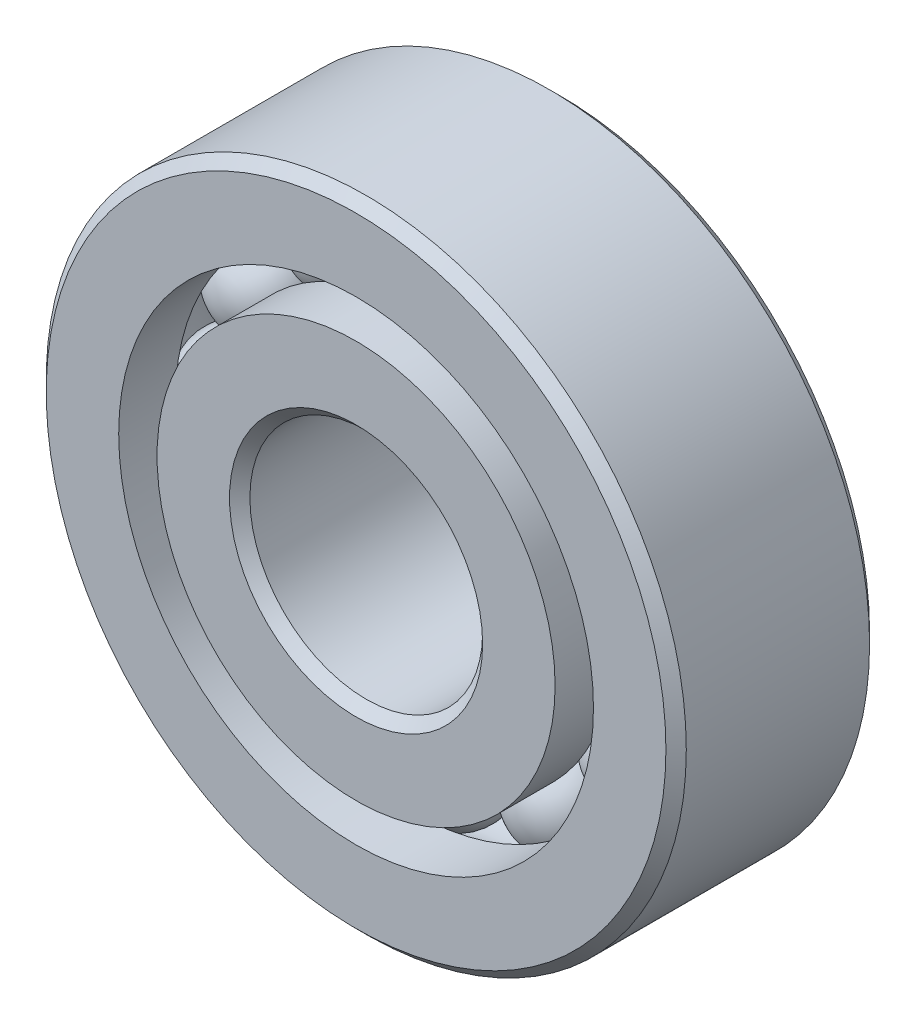
ISO-10303-21;
HEADER;
FILE_DESCRIPTION(('STEP AP214'),'2;1');
FILE_NAME('part.step','',(''),(''),'','','');
FILE_SCHEMA(('AUTOMOTIVE_DESIGN { 1 0 10303 214 1 1 1 1 }'));
ENDSEC;
DATA;
#1=APPLICATION_CONTEXT('core data for automotive mechanical design processes');
#2=APPLICATION_PROTOCOL_DEFINITION('international standard','automotive_design',2000,#1);
#3=PRODUCT_CONTEXT('',#1,'mechanical');
#4=PRODUCT('Part','Part','',(#3));
#5=PRODUCT_RELATED_PRODUCT_CATEGORY('part','',(#4));
#6=PRODUCT_DEFINITION_FORMATION('','',#4);
#7=PRODUCT_DEFINITION_CONTEXT('part definition',#1,'design');
#8=PRODUCT_DEFINITION('design','',#6,#7);
#9=PRODUCT_DEFINITION_SHAPE('','',#8);
#10=(LENGTH_UNIT() NAMED_UNIT(*) SI_UNIT(.MILLI.,.METRE.));
#11=(NAMED_UNIT(*) PLANE_ANGLE_UNIT() SI_UNIT($,.RADIAN.));
#12=(NAMED_UNIT(*) SI_UNIT($,.STERADIAN.) SOLID_ANGLE_UNIT());
#13=UNCERTAINTY_MEASURE_WITH_UNIT(LENGTH_MEASURE(1.E-05),#10,'distance_accuracy_value','');
#14=(GEOMETRIC_REPRESENTATION_CONTEXT(3) GLOBAL_UNCERTAINTY_ASSIGNED_CONTEXT((#13)) GLOBAL_UNIT_ASSIGNED_CONTEXT((#10,
#11,#12)) REPRESENTATION_CONTEXT('',''));
#15=CARTESIAN_POINT('',(0.,0.,0.));
#16=DIRECTION('',(0.,0.,1.));
#17=DIRECTION('',(1.,0.,0.));
#18=AXIS2_PLACEMENT_3D('',#15,#16,#17);
#19=CARTESIAN_POINT('',(-3.74999999999992,6.49519052838334,0.));
#20=DIRECTION('',(0.,0.,1.));
#21=DIRECTION('',(-0.499999999999989,0.866025403784445,0.));
#22=AXIS2_PLACEMENT_3D('',#19,#20,#21);
#23=SPHERICAL_SURFACE('',#22,1.68952158656808);
#24=CARTESIAN_POINT('',(-3.74999999999992,6.49519052838334,1.68952158656808));
#25=VERTEX_POINT('',#24);
#26=VERTEX_LOOP('',#25);
#27=FACE_BOUND('',#26,.T.);
#28=ADVANCED_FACE('F37',(#27),#23,.T.);
#29=CLOSED_SHELL('',(#28));
#30=MANIFOLD_SOLID_BREP('B2',#29);
#31=CARTESIAN_POINT('',(-6.49519052838325,3.75000000000008,0.));
#32=DIRECTION('',(0.,0.,1.));
#33=DIRECTION('',(-0.866025403784433,0.50000000000001,0.));
#34=AXIS2_PLACEMENT_3D('',#31,#32,#33);
#35=SPHERICAL_SURFACE('',#34,1.68952158656808);
#36=CARTESIAN_POINT('',(-6.49519052838325,3.75000000000008,1.68952158656808));
#37=VERTEX_POINT('',#36);
#38=VERTEX_LOOP('',#37);
#39=FACE_BOUND('',#38,.T.);
#40=ADVANCED_FACE('F57',(#39),#35,.T.);
#41=CLOSED_SHELL('',(#40));
#42=MANIFOLD_SOLID_BREP('B6',#41);
#43=CARTESIAN_POINT('',(-7.5,0.,0.));
#44=DIRECTION('',(0.,0.,1.));
#45=DIRECTION('',(-1.,0.,0.));
#46=AXIS2_PLACEMENT_3D('',#43,#44,#45);
#47=SPHERICAL_SURFACE('',#46,1.68952158656808);
#48=CARTESIAN_POINT('',(-7.5,0.,1.68952158656808));
#49=VERTEX_POINT('',#48);
#50=VERTEX_LOOP('',#49);
#51=FACE_BOUND('',#50,.T.);
#52=ADVANCED_FACE('F77',(#51),#47,.T.);
#53=CLOSED_SHELL('',(#52));
#54=MANIFOLD_SOLID_BREP('B33',#53);
#55=CARTESIAN_POINT('',(-6.49519052838332,-3.74999999999994,0.));
#56=DIRECTION('',(0.,0.,1.));
#57=DIRECTION('',(-0.866025403784443,-0.499999999999992,0.));
#58=AXIS2_PLACEMENT_3D('',#55,#56,#57);
#59=SPHERICAL_SURFACE('',#58,1.68952158656808);
#60=CARTESIAN_POINT('',(-6.49519052838332,-3.74999999999994,1.68952158656808));
#61=VERTEX_POINT('',#60);
#62=VERTEX_LOOP('',#61);
#63=FACE_BOUND('',#62,.T.);
#64=ADVANCED_FACE('F97',(#63),#59,.T.);
#65=CLOSED_SHELL('',(#64));
#66=MANIFOLD_SOLID_BREP('B53',#65);
#67=CARTESIAN_POINT('',(-3.75000000000005,-6.49519052838326,0.));
#68=DIRECTION('',(0.,0.,1.));
#69=DIRECTION('',(-0.500000000000007,-0.866025403784435,0.));
#70=AXIS2_PLACEMENT_3D('',#67,#68,#69);
#71=SPHERICAL_SURFACE('',#70,1.68952158656808);
#72=CARTESIAN_POINT('',(-3.75000000000005,-6.49519052838326,1.68952158656808));
#73=VERTEX_POINT('',#72);
#74=VERTEX_LOOP('',#73);
#75=FACE_BOUND('',#74,.T.);
#76=ADVANCED_FACE('F117',(#75),#71,.T.);
#77=CLOSED_SHELL('',(#76));
#78=MANIFOLD_SOLID_BREP('B73',#77);
#79=CARTESIAN_POINT('',(0.,-7.5,0.));
#80=DIRECTION('',(0.,0.,1.));
#81=DIRECTION('',(0.,-1.,0.));
#82=AXIS2_PLACEMENT_3D('',#79,#80,#81);
#83=SPHERICAL_SURFACE('',#82,1.68952158656808);
#84=CARTESIAN_POINT('',(0.,-7.5,1.68952158656808));
#85=VERTEX_POINT('',#84);
#86=VERTEX_LOOP('',#85);
#87=FACE_BOUND('',#86,.T.);
#88=ADVANCED_FACE('F137',(#87),#83,.T.);
#89=CLOSED_SHELL('',(#88));
#90=MANIFOLD_SOLID_BREP('B93',#89);
#91=CARTESIAN_POINT('',(3.74999999999996,-6.49519052838331,0.));
#92=DIRECTION('',(0.,0.,1.));
#93=DIRECTION('',(0.499999999999995,-0.866025403784442,0.));
#94=AXIS2_PLACEMENT_3D('',#91,#92,#93);
#95=SPHERICAL_SURFACE('',#94,1.68952158656808);
#96=CARTESIAN_POINT('',(3.74999999999996,-6.49519052838331,1.68952158656808));
#97=VERTEX_POINT('',#96);
#98=VERTEX_LOOP('',#97);
#99=FACE_BOUND('',#98,.T.);
#100=ADVANCED_FACE('F157',(#99),#95,.T.);
#101=CLOSED_SHELL('',(#100));
#102=MANIFOLD_SOLID_BREP('B113',#101);
#103=CARTESIAN_POINT('',(6.49519052838327,-3.75000000000003,0.));
#104=DIRECTION('',(0.,0.,1.));
#105=DIRECTION('',(0.866025403784436,-0.500000000000004,0.));
#106=AXIS2_PLACEMENT_3D('',#103,#104,#105);
#107=SPHERICAL_SURFACE('',#106,1.68952158656808);
#108=CARTESIAN_POINT('',(6.49519052838327,-3.75000000000003,1.68952158656808));
#109=VERTEX_POINT('',#108);
#110=VERTEX_LOOP('',#109);
#111=FACE_BOUND('',#110,.T.);
#112=ADVANCED_FACE('F177',(#111),#107,.T.);
#113=CLOSED_SHELL('',(#112));
#114=MANIFOLD_SOLID_BREP('B133',#113);
#115=CARTESIAN_POINT('',(7.5,0.,0.));
#116=DIRECTION('',(0.,0.,1.));
#117=DIRECTION('',(1.,0.,0.));
#118=AXIS2_PLACEMENT_3D('',#115,#116,#117);
#119=SPHERICAL_SURFACE('',#118,1.68952158656808);
#120=CARTESIAN_POINT('',(7.5,0.,1.68952158656808));
#121=VERTEX_POINT('',#120);
#122=VERTEX_LOOP('',#121);
#123=FACE_BOUND('',#122,.T.);
#124=ADVANCED_FACE('F197',(#123),#119,.T.);
#125=CLOSED_SHELL('',(#124));
#126=MANIFOLD_SOLID_BREP('B153',#125);
#127=CARTESIAN_POINT('',(6.4951905283833,3.74999999999998,0.));
#128=DIRECTION('',(0.,0.,1.));
#129=DIRECTION('',(0.86602540378444,0.499999999999998,0.));
#130=AXIS2_PLACEMENT_3D('',#127,#128,#129);
#131=SPHERICAL_SURFACE('',#130,1.68952158656808);
#132=CARTESIAN_POINT('',(6.4951905283833,3.74999999999998,1.68952158656808));
#133=VERTEX_POINT('',#132);
#134=VERTEX_LOOP('',#133);
#135=FACE_BOUND('',#134,.T.);
#136=ADVANCED_FACE('F217',(#135),#131,.T.);
#137=CLOSED_SHELL('',(#136));
#138=MANIFOLD_SOLID_BREP('B173',#137);
#139=CARTESIAN_POINT('',(3.75000000000001,6.49519052838328,0.));
#140=DIRECTION('',(0.,0.,1.));
#141=DIRECTION('',(0.500000000000001,0.866025403784438,0.));
#142=AXIS2_PLACEMENT_3D('',#139,#140,#141);
#143=SPHERICAL_SURFACE('',#142,1.68952158656808);
#144=CARTESIAN_POINT('',(3.75000000000001,6.49519052838328,1.68952158656808));
#145=VERTEX_POINT('',#144);
#146=VERTEX_LOOP('',#145);
#147=FACE_BOUND('',#146,.T.);
#148=ADVANCED_FACE('F237',(#147),#143,.T.);
#149=CLOSED_SHELL('',(#148));
#150=MANIFOLD_SOLID_BREP('B193',#149);
#151=CARTESIAN_POINT('',(0.,7.5,0.));
#152=DIRECTION('',(0.,0.,1.));
#153=DIRECTION('',(0.,1.,0.));
#154=AXIS2_PLACEMENT_3D('',#151,#152,#153);
#155=SPHERICAL_SURFACE('',#154,1.68952158656808);
#156=CARTESIAN_POINT('',(0.,7.5,1.68952158656808));
#157=VERTEX_POINT('',#156);
#158=VERTEX_LOOP('',#157);
#159=FACE_BOUND('',#158,.T.);
#160=ADVANCED_FACE('F259',(#159),#155,.T.);
#161=CLOSED_SHELL('',(#160));
#162=MANIFOLD_SOLID_BREP('B213',#161);
#163=CARTESIAN_POINT('',(0.,6.84065934065934,3.5));
#164=DIRECTION('',(0.,0.,-1.));
#165=DIRECTION('',(-1.,0.,0.));
#166=AXIS2_PLACEMENT_3D('',#163,#164,#165);
#167=PLANE('',#166);
#168=CARTESIAN_POINT('',(0.,0.,3.5));
#169=DIRECTION('',(0.,0.,1.));
#170=DIRECTION('',(1.,0.,0.));
#171=AXIS2_PLACEMENT_3D('',#168,#169,#170);
#172=CIRCLE('',#171,4.35);
#173=CARTESIAN_POINT('',(4.35,0.,3.5));
#174=VERTEX_POINT('',#173);
#175=EDGE_CURVE('E306',#174,#174,#172,.T.);
#176=ORIENTED_EDGE('',*,*,#175,.F.);
#177=EDGE_LOOP('',(#176));
#178=FACE_BOUND('',#177,.T.);
#179=CARTESIAN_POINT('',(0.,0.,3.5));
#180=DIRECTION('',(0.,0.,1.));
#181=DIRECTION('',(1.,0.,0.));
#182=AXIS2_PLACEMENT_3D('',#179,#180,#181);
#183=CIRCLE('',#182,6.84065934065934);
#184=CARTESIAN_POINT('',(6.84065934065934,0.,3.5));
#185=VERTEX_POINT('',#184);
#186=EDGE_CURVE('E258',#185,#185,#183,.T.);
#187=ORIENTED_EDGE('',*,*,#186,.T.);
#188=EDGE_LOOP('',(#187));
#189=FACE_BOUND('',#188,.T.);
#190=ADVANCED_FACE('F278',(#178,#189),#167,.F.);
#191=CARTESIAN_POINT('',(0.,0.,3.5));
#192=DIRECTION('',(0.,0.,1.));
#193=DIRECTION('',(1.,0.,0.));
#194=AXIS2_PLACEMENT_3D('',#191,#192,#193);
#195=CYLINDRICAL_SURFACE('',#194,6.84065934065934);
#196=ORIENTED_EDGE('',*,*,#186,.F.);
#197=EDGE_LOOP('',(#196));
#198=FACE_BOUND('',#197,.T.);
#199=CARTESIAN_POINT('',(0.,0.,1.55555555555556));
#200=DIRECTION('',(0.,0.,1.));
#201=DIRECTION('',(1.,0.,0.));
#202=AXIS2_PLACEMENT_3D('',#199,#200,#201);
#203=CIRCLE('',#202,6.84065934065934);
#204=CARTESIAN_POINT('',(6.84065934065934,0.,1.55555555555556));
#205=VERTEX_POINT('',#204);
#206=EDGE_CURVE('E284',#205,#205,#203,.T.);
#207=ORIENTED_EDGE('',*,*,#206,.T.);
#208=EDGE_LOOP('',(#207));
#209=FACE_BOUND('',#208,.T.);
#210=ADVANCED_FACE('F313',(#198,#209),#195,.T.);
#211=CARTESIAN_POINT('',(0.,0.,0.));
#212=DIRECTION('',(0.,0.,1.));
#213=DIRECTION('',(1.,0.,0.));
#214=AXIS2_PLACEMENT_3D('',#211,#212,#213);
#215=TOROIDAL_SURFACE('',#214,7.5,1.68952158656808);
#216=ORIENTED_EDGE('',*,*,#206,.F.);
#217=EDGE_LOOP('',(#216));
#218=FACE_BOUND('',#217,.T.);
#219=CARTESIAN_POINT('',(0.,0.,-1.55555555555556));
#220=DIRECTION('',(0.,0.,1.));
#221=DIRECTION('',(1.,0.,0.));
#222=AXIS2_PLACEMENT_3D('',#219,#220,#221);
#223=CIRCLE('',#222,6.84065934065934);
#224=CARTESIAN_POINT('',(6.84065934065934,0.,-1.55555555555556));
#225=VERTEX_POINT('',#224);
#226=EDGE_CURVE('E288',#225,#225,#223,.T.);
#227=ORIENTED_EDGE('',*,*,#226,.T.);
#228=EDGE_LOOP('',(#227));
#229=FACE_BOUND('',#228,.T.);
#230=ADVANCED_FACE('F317',(#218,#229),#215,.F.);
#231=CARTESIAN_POINT('',(0.,0.,3.5));
#232=DIRECTION('',(0.,0.,1.));
#233=DIRECTION('',(1.,0.,0.));
#234=AXIS2_PLACEMENT_3D('',#231,#232,#233);
#235=CYLINDRICAL_SURFACE('',#234,6.84065934065934);
#236=ORIENTED_EDGE('',*,*,#226,.F.);
#237=EDGE_LOOP('',(#236));
#238=FACE_BOUND('',#237,.T.);
#239=CARTESIAN_POINT('',(0.,0.,-3.5));
#240=DIRECTION('',(0.,0.,1.));
#241=DIRECTION('',(1.,0.,0.));
#242=AXIS2_PLACEMENT_3D('',#239,#240,#241);
#243=CIRCLE('',#242,6.84065934065934);
#244=CARTESIAN_POINT('',(6.84065934065934,0.,-3.5));
#245=VERTEX_POINT('',#244);
#246=EDGE_CURVE('E292',#245,#245,#243,.T.);
#247=ORIENTED_EDGE('',*,*,#246,.T.);
#248=EDGE_LOOP('',(#247));
#249=FACE_BOUND('',#248,.T.);
#250=ADVANCED_FACE('F322',(#238,#249),#235,.T.);
#251=CARTESIAN_POINT('',(0.,4.35,-3.5));
#252=DIRECTION('',(0.,0.,1.));
#253=DIRECTION('',(1.,0.,0.));
#254=AXIS2_PLACEMENT_3D('',#251,#252,#253);
#255=PLANE('',#254);
#256=ORIENTED_EDGE('',*,*,#246,.F.);
#257=EDGE_LOOP('',(#256));
#258=FACE_BOUND('',#257,.T.);
#259=CARTESIAN_POINT('',(0.,0.,-3.5));
#260=DIRECTION('',(0.,0.,1.));
#261=DIRECTION('',(1.,0.,0.));
#262=AXIS2_PLACEMENT_3D('',#259,#260,#261);
#263=CIRCLE('',#262,4.35);
#264=CARTESIAN_POINT('',(4.35,0.,-3.5));
#265=VERTEX_POINT('',#264);
#266=EDGE_CURVE('E297',#265,#265,#263,.T.);
#267=ORIENTED_EDGE('',*,*,#266,.T.);
#268=EDGE_LOOP('',(#267));
#269=FACE_BOUND('',#268,.T.);
#270=ADVANCED_FACE('F328',(#258,#269),#255,.F.);
#271=CARTESIAN_POINT('',(0.,0.,-3.15));
#272=DIRECTION('',(0.,0.,-1.));
#273=DIRECTION('',(-1.,0.,0.));
#274=AXIS2_PLACEMENT_3D('',#271,#272,#273);
#275=CONICAL_SURFACE('',#274,4.,0.785398163397446);
#276=ORIENTED_EDGE('',*,*,#266,.F.);
#277=EDGE_LOOP('',(#276));
#278=FACE_BOUND('',#277,.T.);
#279=CARTESIAN_POINT('',(0.,0.,-3.15));
#280=DIRECTION('',(0.,0.,1.));
#281=DIRECTION('',(1.,0.,0.));
#282=AXIS2_PLACEMENT_3D('',#279,#280,#281);
#283=CIRCLE('',#282,4.);
#284=CARTESIAN_POINT('',(4.,0.,-3.15));
#285=VERTEX_POINT('',#284);
#286=EDGE_CURVE('E300',#285,#285,#283,.T.);
#287=ORIENTED_EDGE('',*,*,#286,.T.);
#288=EDGE_LOOP('',(#287));
#289=FACE_BOUND('',#288,.T.);
#290=ADVANCED_FACE('F332',(#278,#289),#275,.F.);
#291=CARTESIAN_POINT('',(0.,0.,3.5));
#292=DIRECTION('',(0.,0.,1.));
#293=DIRECTION('',(1.,0.,0.));
#294=AXIS2_PLACEMENT_3D('',#291,#292,#293);
#295=CYLINDRICAL_SURFACE('',#294,4.);
#296=ORIENTED_EDGE('',*,*,#286,.F.);
#297=EDGE_LOOP('',(#296));
#298=FACE_BOUND('',#297,.T.);
#299=CARTESIAN_POINT('',(0.,0.,3.15));
#300=DIRECTION('',(0.,0.,1.));
#301=DIRECTION('',(1.,0.,0.));
#302=AXIS2_PLACEMENT_3D('',#299,#300,#301);
#303=CIRCLE('',#302,4.);
#304=CARTESIAN_POINT('',(4.,0.,3.15));
#305=VERTEX_POINT('',#304);
#306=EDGE_CURVE('E303',#305,#305,#303,.T.);
#307=ORIENTED_EDGE('',*,*,#306,.T.);
#308=EDGE_LOOP('',(#307));
#309=FACE_BOUND('',#308,.T.);
#310=ADVANCED_FACE('F336',(#298,#309),#295,.F.);
#311=CARTESIAN_POINT('',(0.,0.,3.5));
#312=DIRECTION('',(0.,0.,1.));
#313=DIRECTION('',(1.,0.,0.));
#314=AXIS2_PLACEMENT_3D('',#311,#312,#313);
#315=CONICAL_SURFACE('',#314,4.35,0.785398163397449);
#316=ORIENTED_EDGE('',*,*,#306,.F.);
#317=EDGE_LOOP('',(#316));
#318=FACE_BOUND('',#317,.T.);
#319=ORIENTED_EDGE('',*,*,#175,.T.);
#320=EDGE_LOOP('',(#319));
#321=FACE_BOUND('',#320,.T.);
#322=ADVANCED_FACE('F310',(#318,#321),#315,.F.);
#323=CLOSED_SHELL('',(#190,#210,#230,#250,#270,#290,#310,#322));
#324=MANIFOLD_SOLID_BREP('B233',#323);
#325=CARTESIAN_POINT('',(0.,0.,3.15));
#326=DIRECTION('',(0.,0.,-1.));
#327=DIRECTION('',(-1.,0.,0.));
#328=AXIS2_PLACEMENT_3D('',#325,#326,#327);
#329=CONICAL_SURFACE('',#328,11.,0.785398163397448);
#330=CARTESIAN_POINT('',(0.,0.,3.5));
#331=DIRECTION('',(0.,0.,1.));
#332=DIRECTION('',(1.,0.,0.));
#333=AXIS2_PLACEMENT_3D('',#330,#331,#332);
#334=CIRCLE('',#333,10.65);
#335=CARTESIAN_POINT('',(10.65,0.,3.5));
#336=VERTEX_POINT('',#335);
#337=EDGE_CURVE('E427',#336,#336,#334,.T.);
#338=ORIENTED_EDGE('',*,*,#337,.F.);
#339=EDGE_LOOP('',(#338));
#340=FACE_BOUND('',#339,.T.);
#341=CARTESIAN_POINT('',(0.,0.,3.15));
#342=DIRECTION('',(0.,0.,1.));
#343=DIRECTION('',(1.,0.,0.));
#344=AXIS2_PLACEMENT_3D('',#341,#342,#343);
#345=CIRCLE('',#344,11.);
#346=CARTESIAN_POINT('',(11.,0.,3.15));
#347=VERTEX_POINT('',#346);
#348=EDGE_CURVE('E277',#347,#347,#345,.T.);
#349=ORIENTED_EDGE('',*,*,#348,.T.);
#350=EDGE_LOOP('',(#349));
#351=FACE_BOUND('',#350,.T.);
#352=ADVANCED_FACE('F399',(#340,#351),#329,.T.);
#353=CARTESIAN_POINT('',(0.,0.,3.5));
#354=DIRECTION('',(0.,0.,1.));
#355=DIRECTION('',(1.,0.,0.));
#356=AXIS2_PLACEMENT_3D('',#353,#354,#355);
#357=CYLINDRICAL_SURFACE('',#356,11.);
#358=ORIENTED_EDGE('',*,*,#348,.F.);
#359=EDGE_LOOP('',(#358));
#360=FACE_BOUND('',#359,.T.);
#361=CARTESIAN_POINT('',(0.,0.,-3.15));
#362=DIRECTION('',(0.,0.,1.));
#363=DIRECTION('',(1.,0.,0.));
#364=AXIS2_PLACEMENT_3D('',#361,#362,#363);
#365=CIRCLE('',#364,11.);
#366=CARTESIAN_POINT('',(11.,0.,-3.15));
#367=VERTEX_POINT('',#366);
#368=EDGE_CURVE('E405',#367,#367,#365,.T.);
#369=ORIENTED_EDGE('',*,*,#368,.T.);
#370=EDGE_LOOP('',(#369));
#371=FACE_BOUND('',#370,.T.);
#372=ADVANCED_FACE('F434',(#360,#371),#357,.T.);
#373=CARTESIAN_POINT('',(0.,0.,-3.5));
#374=DIRECTION('',(0.,0.,1.));
#375=DIRECTION('',(1.,0.,0.));
#376=AXIS2_PLACEMENT_3D('',#373,#374,#375);
#377=CONICAL_SURFACE('',#376,10.65,0.785398163397447);
#378=ORIENTED_EDGE('',*,*,#368,.F.);
#379=EDGE_LOOP('',(#378));
#380=FACE_BOUND('',#379,.T.);
#381=CARTESIAN_POINT('',(0.,0.,-3.5));
#382=DIRECTION('',(0.,0.,1.));
#383=DIRECTION('',(1.,0.,0.));
#384=AXIS2_PLACEMENT_3D('',#381,#382,#383);
#385=CIRCLE('',#384,10.65);
#386=CARTESIAN_POINT('',(10.65,0.,-3.5));
#387=VERTEX_POINT('',#386);
#388=EDGE_CURVE('E409',#387,#387,#385,.T.);
#389=ORIENTED_EDGE('',*,*,#388,.T.);
#390=EDGE_LOOP('',(#389));
#391=FACE_BOUND('',#390,.T.);
#392=ADVANCED_FACE('F438',(#380,#391),#377,.T.);
#393=CARTESIAN_POINT('',(0.,10.65,-3.5));
#394=DIRECTION('',(0.,0.,1.));
#395=DIRECTION('',(1.,0.,0.));
#396=AXIS2_PLACEMENT_3D('',#393,#394,#395);
#397=PLANE('',#396);
#398=ORIENTED_EDGE('',*,*,#388,.F.);
#399=EDGE_LOOP('',(#398));
#400=FACE_BOUND('',#399,.T.);
#401=CARTESIAN_POINT('',(0.,0.,-3.5));
#402=DIRECTION('',(0.,0.,1.));
#403=DIRECTION('',(1.,0.,0.));
#404=AXIS2_PLACEMENT_3D('',#401,#402,#403);
#405=CIRCLE('',#404,8.15934065934066);
#406=CARTESIAN_POINT('',(8.15934065934066,0.,-3.5));
#407=VERTEX_POINT('',#406);
#408=EDGE_CURVE('E413',#407,#407,#405,.T.);
#409=ORIENTED_EDGE('',*,*,#408,.T.);
#410=EDGE_LOOP('',(#409));
#411=FACE_BOUND('',#410,.T.);
#412=ADVANCED_FACE('F443',(#400,#411),#397,.F.);
#413=CARTESIAN_POINT('',(0.,0.,3.5));
#414=DIRECTION('',(0.,0.,1.));
#415=DIRECTION('',(1.,0.,0.));
#416=AXIS2_PLACEMENT_3D('',#413,#414,#415);
#417=CYLINDRICAL_SURFACE('',#416,8.15934065934066);
#418=ORIENTED_EDGE('',*,*,#408,.F.);
#419=EDGE_LOOP('',(#418));
#420=FACE_BOUND('',#419,.T.);
#421=CARTESIAN_POINT('',(0.,0.,-1.55555555555556));
#422=DIRECTION('',(0.,0.,1.));
#423=DIRECTION('',(1.,0.,0.));
#424=AXIS2_PLACEMENT_3D('',#421,#422,#423);
#425=CIRCLE('',#424,8.15934065934066);
#426=CARTESIAN_POINT('',(8.15934065934066,0.,-1.55555555555556));
#427=VERTEX_POINT('',#426);
#428=EDGE_CURVE('E418',#427,#427,#425,.T.);
#429=ORIENTED_EDGE('',*,*,#428,.T.);
#430=EDGE_LOOP('',(#429));
#431=FACE_BOUND('',#430,.T.);
#432=ADVANCED_FACE('F449',(#420,#431),#417,.F.);
#433=CARTESIAN_POINT('',(0.,0.,0.));
#434=DIRECTION('',(0.,0.,1.));
#435=DIRECTION('',(1.,0.,0.));
#436=AXIS2_PLACEMENT_3D('',#433,#434,#435);
#437=TOROIDAL_SURFACE('',#436,7.5,1.68952158656808);
#438=ORIENTED_EDGE('',*,*,#428,.F.);
#439=EDGE_LOOP('',(#438));
#440=FACE_BOUND('',#439,.T.);
#441=CARTESIAN_POINT('',(0.,0.,1.55555555555555));
#442=DIRECTION('',(0.,0.,1.));
#443=DIRECTION('',(1.,0.,0.));
#444=AXIS2_PLACEMENT_3D('',#441,#442,#443);
#445=CIRCLE('',#444,8.15934065934066);
#446=CARTESIAN_POINT('',(8.15934065934066,0.,1.55555555555555));
#447=VERTEX_POINT('',#446);
#448=EDGE_CURVE('E421',#447,#447,#445,.T.);
#449=ORIENTED_EDGE('',*,*,#448,.T.);
#450=EDGE_LOOP('',(#449));
#451=FACE_BOUND('',#450,.T.);
#452=ADVANCED_FACE('F453',(#440,#451),#437,.F.);
#453=CARTESIAN_POINT('',(0.,0.,3.5));
#454=DIRECTION('',(0.,0.,1.));
#455=DIRECTION('',(1.,0.,0.));
#456=AXIS2_PLACEMENT_3D('',#453,#454,#455);
#457=CYLINDRICAL_SURFACE('',#456,8.15934065934066);
#458=ORIENTED_EDGE('',*,*,#448,.F.);
#459=EDGE_LOOP('',(#458));
#460=FACE_BOUND('',#459,.T.);
#461=CARTESIAN_POINT('',(0.,0.,3.5));
#462=DIRECTION('',(0.,0.,1.));
#463=DIRECTION('',(1.,0.,0.));
#464=AXIS2_PLACEMENT_3D('',#461,#462,#463);
#465=CIRCLE('',#464,8.15934065934066);
#466=CARTESIAN_POINT('',(8.15934065934066,0.,3.5));
#467=VERTEX_POINT('',#466);
#468=EDGE_CURVE('E424',#467,#467,#465,.T.);
#469=ORIENTED_EDGE('',*,*,#468,.T.);
#470=EDGE_LOOP('',(#469));
#471=FACE_BOUND('',#470,.T.);
#472=ADVANCED_FACE('F457',(#460,#471),#457,.F.);
#473=CARTESIAN_POINT('',(0.,10.65,3.5));
#474=DIRECTION('',(0.,0.,-1.));
#475=DIRECTION('',(-1.,0.,0.));
#476=AXIS2_PLACEMENT_3D('',#473,#474,#475);
#477=PLANE('',#476);
#478=ORIENTED_EDGE('',*,*,#468,.F.);
#479=EDGE_LOOP('',(#478));
#480=FACE_BOUND('',#479,.T.);
#481=ORIENTED_EDGE('',*,*,#337,.T.);
#482=EDGE_LOOP('',(#481));
#483=FACE_BOUND('',#482,.T.);
#484=ADVANCED_FACE('F431',(#480,#483),#477,.F.);
#485=CLOSED_SHELL('',(#352,#372,#392,#412,#432,#452,#472,#484));
#486=MANIFOLD_SOLID_BREP('B253',#485);
#487=ADVANCED_BREP_SHAPE_REPRESENTATION('',(#18,#30,#42,#54,#66,#78,#90,#102,#114,#126,#138,
#150,#162,#324,#486),#14);
#488=SHAPE_DEFINITION_REPRESENTATION(#9,#487);
ENDSEC;
END-ISO-10303-21;
